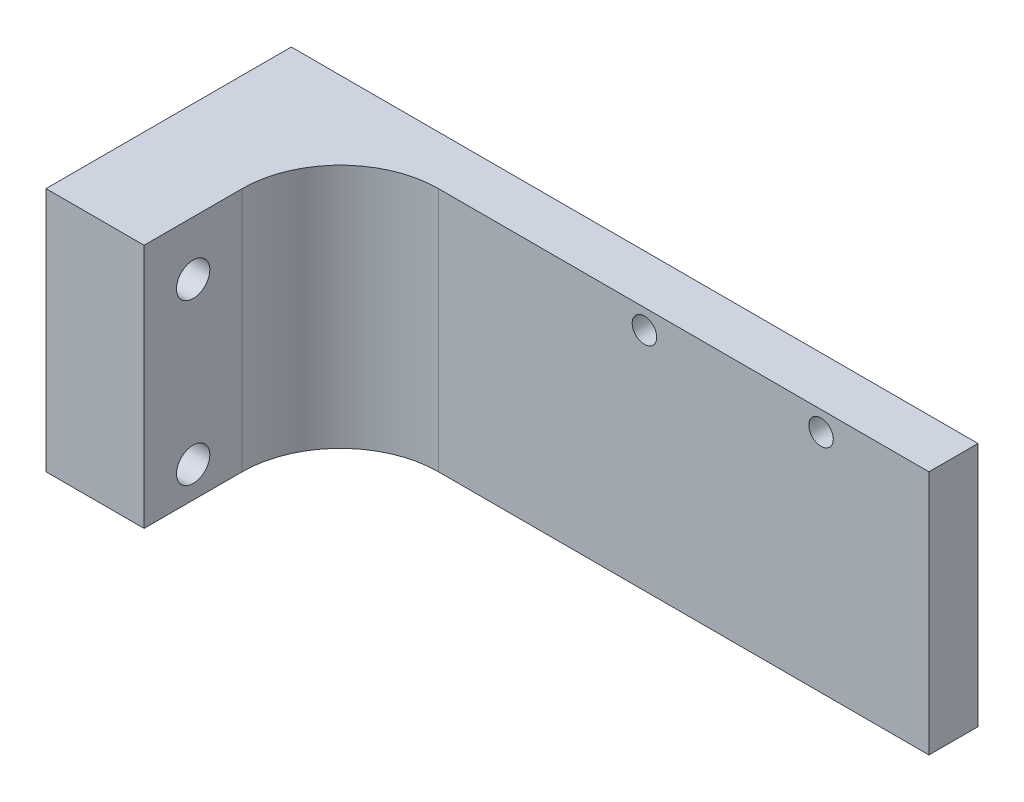
ISO-10303-21;
HEADER;
FILE_DESCRIPTION(('STEP AP214'),'2;1');
FILE_NAME('part.step','',(''),(''),'','','');
FILE_SCHEMA(('AUTOMOTIVE_DESIGN { 1 0 10303 214 1 1 1 1 }'));
ENDSEC;
DATA;
#1=APPLICATION_CONTEXT('core data for automotive mechanical design processes');
#2=APPLICATION_PROTOCOL_DEFINITION('international standard','automotive_design',2000,#1);
#3=PRODUCT_CONTEXT('',#1,'mechanical');
#4=PRODUCT('Part','Part','',(#3));
#5=PRODUCT_RELATED_PRODUCT_CATEGORY('part','',(#4));
#6=PRODUCT_DEFINITION_FORMATION('','',#4);
#7=PRODUCT_DEFINITION_CONTEXT('part definition',#1,'design');
#8=PRODUCT_DEFINITION('design','',#6,#7);
#9=PRODUCT_DEFINITION_SHAPE('','',#8);
#10=(LENGTH_UNIT() NAMED_UNIT(*) SI_UNIT(.MILLI.,.METRE.));
#11=(NAMED_UNIT(*) PLANE_ANGLE_UNIT() SI_UNIT($,.RADIAN.));
#12=(NAMED_UNIT(*) SI_UNIT($,.STERADIAN.) SOLID_ANGLE_UNIT());
#13=UNCERTAINTY_MEASURE_WITH_UNIT(LENGTH_MEASURE(1.E-05),#10,'distance_accuracy_value','');
#14=(GEOMETRIC_REPRESENTATION_CONTEXT(3) GLOBAL_UNCERTAINTY_ASSIGNED_CONTEXT((#13)) GLOBAL_UNIT_ASSIGNED_CONTEXT((#10,
#11,#12)) REPRESENTATION_CONTEXT('',''));
#15=CARTESIAN_POINT('',(0.,0.,0.));
#16=DIRECTION('',(0.,0.,1.));
#17=DIRECTION('',(1.,0.,0.));
#18=AXIS2_PLACEMENT_3D('',#15,#16,#17);
#19=CARTESIAN_POINT('',(0.,0.,5.));
#20=DIRECTION('',(1.,0.,0.));
#21=DIRECTION('',(0.,1.,0.));
#22=AXIS2_PLACEMENT_3D('',#19,#20,#21);
#23=PLANE('',#22);
#24=CARTESIAN_POINT('',(0.,-21.8349192381209,20.));
#25=DIRECTION('',(1.,0.,0.));
#26=DIRECTION('',(0.,1.,0.));
#27=AXIS2_PLACEMENT_3D('',#24,#25,#26);
#28=CIRCLE('',#27,1.7);
#29=CARTESIAN_POINT('',(0.,-20.1349192381209,20.));
#30=VERTEX_POINT('',#29);
#31=EDGE_CURVE('E120',#30,#30,#28,.T.);
#32=ORIENTED_EDGE('',*,*,#31,.T.);
#33=EDGE_LOOP('',(#32));
#34=FACE_BOUND('',#33,.T.);
#35=CARTESIAN_POINT('',(0.,-5.50310841636206,20.));
#36=DIRECTION('',(1.,0.,0.));
#37=DIRECTION('',(0.,1.,0.));
#38=AXIS2_PLACEMENT_3D('',#35,#36,#37);
#39=CIRCLE('',#38,1.7);
#40=CARTESIAN_POINT('',(0.,-3.80310841636206,20.));
#41=VERTEX_POINT('',#40);
#42=EDGE_CURVE('E255',#41,#41,#39,.T.);
#43=ORIENTED_EDGE('',*,*,#42,.T.);
#44=EDGE_LOOP('',(#43));
#45=FACE_BOUND('',#44,.T.);
#46=DIRECTION('',(0.,-1.,0.));
#47=VECTOR('',#46,1.);
#48=CARTESIAN_POINT('',(0.,0.,0.));
#49=LINE('',#48,#47);
#50=CARTESIAN_POINT('',(0.,0.,0.));
#51=VERTEX_POINT('',#50);
#52=CARTESIAN_POINT('',(0.,-25.,0.));
#53=VERTEX_POINT('',#52);
#54=EDGE_CURVE('E142',#51,#53,#49,.T.);
#55=ORIENTED_EDGE('',*,*,#54,.T.);
#56=DIRECTION('',(0.,0.,-1.));
#57=VECTOR('',#56,1.);
#58=CARTESIAN_POINT('',(0.,-25.,5.));
#59=LINE('',#58,#57);
#60=CARTESIAN_POINT('',(0.,-25.,25.));
#61=VERTEX_POINT('',#60);
#62=EDGE_CURVE('E181',#61,#53,#59,.T.);
#63=ORIENTED_EDGE('',*,*,#62,.F.);
#64=DIRECTION('',(0.,-1.,0.));
#65=VECTOR('',#64,1.);
#66=CARTESIAN_POINT('',(0.,0.,25.));
#67=LINE('',#66,#65);
#68=CARTESIAN_POINT('',(0.,0.,25.));
#69=VERTEX_POINT('',#68);
#70=EDGE_CURVE('E109',#69,#61,#67,.T.);
#71=ORIENTED_EDGE('',*,*,#70,.F.);
#72=DIRECTION('',(0.,0.,-1.));
#73=VECTOR('',#72,1.);
#74=CARTESIAN_POINT('',(0.,0.,5.));
#75=LINE('',#74,#73);
#76=EDGE_CURVE('E104',#69,#51,#75,.T.);
#77=ORIENTED_EDGE('',*,*,#76,.T.);
#78=EDGE_LOOP('',(#55,#63,#71,#77));
#79=FACE_BOUND('',#78,.T.);
#80=ADVANCED_FACE('F41',(#34,#45,#79),#23,.F.);
#81=CARTESIAN_POINT('',(0.,-25.,5.));
#82=DIRECTION('',(0.,1.,0.));
#83=DIRECTION('',(0.,0.,1.));
#84=AXIS2_PLACEMENT_3D('',#81,#82,#83);
#85=PLANE('',#84);
#86=DIRECTION('',(1.,0.,0.));
#87=VECTOR('',#86,1.);
#88=CARTESIAN_POINT('',(0.,-25.,0.));
#89=LINE('',#88,#87);
#90=CARTESIAN_POINT('',(70.,-25.,0.));
#91=VERTEX_POINT('',#90);
#92=EDGE_CURVE('E163',#53,#91,#89,.T.);
#93=ORIENTED_EDGE('',*,*,#92,.T.);
#94=DIRECTION('',(0.,0.,-1.));
#95=VECTOR('',#94,1.);
#96=CARTESIAN_POINT('',(70.,-25.,5.));
#97=LINE('',#96,#95);
#98=CARTESIAN_POINT('',(70.,-25.,5.));
#99=VERTEX_POINT('',#98);
#100=EDGE_CURVE('E177',#99,#91,#97,.T.);
#101=ORIENTED_EDGE('',*,*,#100,.F.);
#102=DIRECTION('',(1.,0.,0.));
#103=VECTOR('',#102,1.);
#104=CARTESIAN_POINT('',(0.,-25.,5.));
#105=LINE('',#104,#103);
#106=CARTESIAN_POINT('',(20.,-25.,5.));
#107=VERTEX_POINT('',#106);
#108=EDGE_CURVE('E150',#107,#99,#105,.T.);
#109=ORIENTED_EDGE('',*,*,#108,.F.);
#110=CARTESIAN_POINT('',(20.,-25.,15.));
#111=DIRECTION('',(0.,1.,0.));
#112=DIRECTION('',(0.,0.,1.));
#113=AXIS2_PLACEMENT_3D('',#110,#111,#112);
#114=CIRCLE('',#113,10.);
#115=CARTESIAN_POINT('',(10.,-25.,15.));
#116=VERTEX_POINT('',#115);
#117=EDGE_CURVE('E11',#107,#116,#114,.T.);
#118=ORIENTED_EDGE('',*,*,#117,.T.);
#119=DIRECTION('',(0.,0.,-1.));
#120=VECTOR('',#119,1.);
#121=CARTESIAN_POINT('',(10.,-25.,25.));
#122=LINE('',#121,#120);
#123=CARTESIAN_POINT('',(10.,-25.,25.));
#124=VERTEX_POINT('',#123);
#125=EDGE_CURVE('E128',#124,#116,#122,.T.);
#126=ORIENTED_EDGE('',*,*,#125,.F.);
#127=DIRECTION('',(1.,0.,0.));
#128=VECTOR('',#127,1.);
#129=CARTESIAN_POINT('',(0.,-25.,25.));
#130=LINE('',#129,#128);
#131=EDGE_CURVE('E115',#61,#124,#130,.T.);
#132=ORIENTED_EDGE('',*,*,#131,.F.);
#133=ORIENTED_EDGE('',*,*,#62,.T.);
#134=EDGE_LOOP('',(#93,#101,#109,#118,#126,#132,#133));
#135=FACE_BOUND('',#134,.T.);
#136=ADVANCED_FACE('F190',(#135),#85,.F.);
#137=CARTESIAN_POINT('',(70.,0.,5.));
#138=DIRECTION('',(-1.,0.,0.));
#139=DIRECTION('',(0.,0.,1.));
#140=AXIS2_PLACEMENT_3D('',#137,#138,#139);
#141=PLANE('',#140);
#142=DIRECTION('',(0.,1.,0.));
#143=VECTOR('',#142,1.);
#144=CARTESIAN_POINT('',(70.,0.,0.));
#145=LINE('',#144,#143);
#146=CARTESIAN_POINT('',(70.,0.,0.));
#147=VERTEX_POINT('',#146);
#148=EDGE_CURVE('E166',#91,#147,#145,.T.);
#149=ORIENTED_EDGE('',*,*,#148,.T.);
#150=DIRECTION('',(0.,0.,-1.));
#151=VECTOR('',#150,1.);
#152=CARTESIAN_POINT('',(70.,0.,5.));
#153=LINE('',#152,#151);
#154=CARTESIAN_POINT('',(70.,0.,5.));
#155=VERTEX_POINT('',#154);
#156=EDGE_CURVE('E173',#155,#147,#153,.T.);
#157=ORIENTED_EDGE('',*,*,#156,.F.);
#158=DIRECTION('',(0.,1.,0.));
#159=VECTOR('',#158,1.);
#160=CARTESIAN_POINT('',(70.,0.,5.));
#161=LINE('',#160,#159);
#162=EDGE_CURVE('E153',#99,#155,#161,.T.);
#163=ORIENTED_EDGE('',*,*,#162,.F.);
#164=ORIENTED_EDGE('',*,*,#100,.T.);
#165=EDGE_LOOP('',(#149,#157,#163,#164));
#166=FACE_BOUND('',#165,.T.);
#167=ADVANCED_FACE('F200',(#166),#141,.F.);
#168=CARTESIAN_POINT('',(0.,0.,5.));
#169=DIRECTION('',(0.,-1.,0.));
#170=DIRECTION('',(0.,0.,-1.));
#171=AXIS2_PLACEMENT_3D('',#168,#169,#170);
#172=PLANE('',#171);
#173=DIRECTION('',(-1.,0.,0.));
#174=VECTOR('',#173,1.);
#175=CARTESIAN_POINT('',(0.,0.,0.));
#176=LINE('',#175,#174);
#177=EDGE_CURVE('E154',#147,#51,#176,.T.);
#178=ORIENTED_EDGE('',*,*,#177,.T.);
#179=ORIENTED_EDGE('',*,*,#76,.F.);
#180=DIRECTION('',(-1.,0.,0.));
#181=VECTOR('',#180,1.);
#182=CARTESIAN_POINT('',(0.,0.,25.));
#183=LINE('',#182,#181);
#184=CARTESIAN_POINT('',(10.,0.,25.));
#185=VERTEX_POINT('',#184);
#186=EDGE_CURVE('E98',#185,#69,#183,.T.);
#187=ORIENTED_EDGE('',*,*,#186,.F.);
#188=DIRECTION('',(0.,0.,-1.));
#189=VECTOR('',#188,1.);
#190=CARTESIAN_POINT('',(10.,0.,25.));
#191=LINE('',#190,#189);
#192=CARTESIAN_POINT('',(10.,0.,15.));
#193=VERTEX_POINT('',#192);
#194=EDGE_CURVE('E102',#185,#193,#191,.T.);
#195=ORIENTED_EDGE('',*,*,#194,.T.);
#196=CARTESIAN_POINT('',(20.,0.,15.));
#197=DIRECTION('',(0.,-1.,0.));
#198=DIRECTION('',(0.,0.,-1.));
#199=AXIS2_PLACEMENT_3D('',#196,#197,#198);
#200=CIRCLE('',#199,10.);
#201=CARTESIAN_POINT('',(20.,0.,5.));
#202=VERTEX_POINT('',#201);
#203=EDGE_CURVE('E50',#193,#202,#200,.T.);
#204=ORIENTED_EDGE('',*,*,#203,.T.);
#205=DIRECTION('',(-1.,0.,0.));
#206=VECTOR('',#205,1.);
#207=CARTESIAN_POINT('',(0.,0.,5.));
#208=LINE('',#207,#206);
#209=EDGE_CURVE('E157',#155,#202,#208,.T.);
#210=ORIENTED_EDGE('',*,*,#209,.F.);
#211=ORIENTED_EDGE('',*,*,#156,.T.);
#212=EDGE_LOOP('',(#178,#179,#187,#195,#204,#210,#211));
#213=FACE_BOUND('',#212,.T.);
#214=ADVANCED_FACE('F100',(#213),#172,.F.);
#215=CARTESIAN_POINT('',(0.,0.,5.));
#216=DIRECTION('',(0.,0.,1.));
#217=DIRECTION('',(1.,0.,0.));
#218=AXIS2_PLACEMENT_3D('',#215,#216,#217);
#219=PLANE('',#218);
#220=ORIENTED_EDGE('',*,*,#209,.T.);
#221=DIRECTION('',(0.,1.,0.));
#222=VECTOR('',#221,1.);
#223=CARTESIAN_POINT('',(20.,0.,5.));
#224=LINE('',#223,#222);
#225=EDGE_CURVE('E63',#202,#107,#224,.F.);
#226=ORIENTED_EDGE('',*,*,#225,.T.);
#227=ORIENTED_EDGE('',*,*,#108,.T.);
#228=ORIENTED_EDGE('',*,*,#162,.T.);
#229=EDGE_LOOP('',(#220,#226,#227,#228));
#230=FACE_BOUND('',#229,.T.);
#231=CARTESIAN_POINT('',(41.,-2.,5.));
#232=DIRECTION('',(0.,0.,1.));
#233=DIRECTION('',(1.,0.,0.));
#234=AXIS2_PLACEMENT_3D('',#231,#232,#233);
#235=CIRCLE('',#234,1.25);
#236=CARTESIAN_POINT('',(42.25,-2.,5.));
#237=VERTEX_POINT('',#236);
#238=EDGE_CURVE('E143',#237,#237,#235,.T.);
#239=ORIENTED_EDGE('',*,*,#238,.F.);
#240=EDGE_LOOP('',(#239));
#241=FACE_BOUND('',#240,.T.);
#242=CARTESIAN_POINT('',(59.,-2.,5.));
#243=DIRECTION('',(0.,0.,1.));
#244=DIRECTION('',(1.,0.,0.));
#245=AXIS2_PLACEMENT_3D('',#242,#243,#244);
#246=CIRCLE('',#245,1.25);
#247=CARTESIAN_POINT('',(60.25,-2.,5.));
#248=VERTEX_POINT('',#247);
#249=EDGE_CURVE('E127',#248,#248,#246,.T.);
#250=ORIENTED_EDGE('',*,*,#249,.F.);
#251=EDGE_LOOP('',(#250));
#252=FACE_BOUND('',#251,.T.);
#253=ADVANCED_FACE('F202',(#230,#241,#252),#219,.T.);
#254=CARTESIAN_POINT('',(0.,0.,0.));
#255=DIRECTION('',(0.,0.,1.));
#256=DIRECTION('',(1.,0.,0.));
#257=AXIS2_PLACEMENT_3D('',#254,#255,#256);
#258=PLANE('',#257);
#259=CARTESIAN_POINT('',(41.,-2.,0.));
#260=DIRECTION('',(0.,0.,1.));
#261=DIRECTION('',(1.,0.,0.));
#262=AXIS2_PLACEMENT_3D('',#259,#260,#261);
#263=CIRCLE('',#262,1.25);
#264=CARTESIAN_POINT('',(42.25,-2.,0.));
#265=VERTEX_POINT('',#264);
#266=EDGE_CURVE('E138',#265,#265,#263,.T.);
#267=ORIENTED_EDGE('',*,*,#266,.T.);
#268=EDGE_LOOP('',(#267));
#269=FACE_BOUND('',#268,.T.);
#270=CARTESIAN_POINT('',(59.,-2.,0.));
#271=DIRECTION('',(0.,0.,1.));
#272=DIRECTION('',(1.,0.,0.));
#273=AXIS2_PLACEMENT_3D('',#270,#271,#272);
#274=CIRCLE('',#273,1.25);
#275=CARTESIAN_POINT('',(60.25,-2.,0.));
#276=VERTEX_POINT('',#275);
#277=EDGE_CURVE('E133',#276,#276,#274,.T.);
#278=ORIENTED_EDGE('',*,*,#277,.T.);
#279=EDGE_LOOP('',(#278));
#280=FACE_BOUND('',#279,.T.);
#281=ORIENTED_EDGE('',*,*,#54,.F.);
#282=ORIENTED_EDGE('',*,*,#177,.F.);
#283=ORIENTED_EDGE('',*,*,#148,.F.);
#284=ORIENTED_EDGE('',*,*,#92,.F.);
#285=EDGE_LOOP('',(#281,#282,#283,#284));
#286=FACE_BOUND('',#285,.T.);
#287=ADVANCED_FACE('F196',(#269,#280,#286),#258,.F.);
#288=CARTESIAN_POINT('',(59.,-2.,0.));
#289=DIRECTION('',(0.,0.,1.));
#290=DIRECTION('',(1.,0.,0.));
#291=AXIS2_PLACEMENT_3D('',#288,#289,#290);
#292=CYLINDRICAL_SURFACE('',#291,1.25);
#293=ORIENTED_EDGE('',*,*,#277,.F.);
#294=EDGE_LOOP('',(#293));
#295=FACE_BOUND('',#294,.T.);
#296=ORIENTED_EDGE('',*,*,#249,.T.);
#297=EDGE_LOOP('',(#296));
#298=FACE_BOUND('',#297,.T.);
#299=ADVANCED_FACE('F231',(#295,#298),#292,.F.);
#300=CARTESIAN_POINT('',(41.,-2.,0.));
#301=DIRECTION('',(0.,0.,1.));
#302=DIRECTION('',(1.,0.,0.));
#303=AXIS2_PLACEMENT_3D('',#300,#301,#302);
#304=CYLINDRICAL_SURFACE('',#303,1.25);
#305=ORIENTED_EDGE('',*,*,#266,.F.);
#306=EDGE_LOOP('',(#305));
#307=FACE_BOUND('',#306,.T.);
#308=ORIENTED_EDGE('',*,*,#238,.T.);
#309=EDGE_LOOP('',(#308));
#310=FACE_BOUND('',#309,.T.);
#311=ADVANCED_FACE('F237',(#307,#310),#304,.F.);
#312=CARTESIAN_POINT('',(10.,0.,25.));
#313=DIRECTION('',(-1.,0.,0.));
#314=DIRECTION('',(0.,-1.,0.));
#315=AXIS2_PLACEMENT_3D('',#312,#313,#314);
#316=PLANE('',#315);
#317=CARTESIAN_POINT('',(10.,-21.8349192381209,20.));
#318=DIRECTION('',(1.,0.,0.));
#319=DIRECTION('',(0.,1.,0.));
#320=AXIS2_PLACEMENT_3D('',#317,#318,#319);
#321=CIRCLE('',#320,1.7);
#322=CARTESIAN_POINT('',(10.,-20.1349192381209,20.));
#323=VERTEX_POINT('',#322);
#324=EDGE_CURVE('E253',#323,#323,#321,.T.);
#325=ORIENTED_EDGE('',*,*,#324,.F.);
#326=EDGE_LOOP('',(#325));
#327=FACE_BOUND('',#326,.T.);
#328=CARTESIAN_POINT('',(10.,-5.50310841636205,20.));
#329=DIRECTION('',(1.,0.,0.));
#330=DIRECTION('',(0.,1.,0.));
#331=AXIS2_PLACEMENT_3D('',#328,#329,#330);
#332=CIRCLE('',#331,1.7);
#333=CARTESIAN_POINT('',(10.,-3.80310841636205,20.));
#334=VERTEX_POINT('',#333);
#335=EDGE_CURVE('E261',#334,#334,#332,.T.);
#336=ORIENTED_EDGE('',*,*,#335,.F.);
#337=EDGE_LOOP('',(#336));
#338=FACE_BOUND('',#337,.T.);
#339=ORIENTED_EDGE('',*,*,#125,.T.);
#340=DIRECTION('',(0.,1.,0.));
#341=VECTOR('',#340,1.);
#342=CARTESIAN_POINT('',(10.,0.,15.));
#343=LINE('',#342,#341);
#344=EDGE_CURVE('E125',#116,#193,#343,.T.);
#345=ORIENTED_EDGE('',*,*,#344,.T.);
#346=ORIENTED_EDGE('',*,*,#194,.F.);
#347=DIRECTION('',(0.,1.,0.));
#348=VECTOR('',#347,1.);
#349=CARTESIAN_POINT('',(10.,0.,25.));
#350=LINE('',#349,#348);
#351=EDGE_CURVE('E110',#124,#185,#350,.T.);
#352=ORIENTED_EDGE('',*,*,#351,.F.);
#353=EDGE_LOOP('',(#339,#345,#346,#352));
#354=FACE_BOUND('',#353,.T.);
#355=ADVANCED_FACE('F123',(#327,#338,#354),#316,.F.);
#356=CARTESIAN_POINT('',(0.,0.,25.));
#357=DIRECTION('',(0.,0.,1.));
#358=DIRECTION('',(1.,0.,0.));
#359=AXIS2_PLACEMENT_3D('',#356,#357,#358);
#360=PLANE('',#359);
#361=ORIENTED_EDGE('',*,*,#351,.T.);
#362=ORIENTED_EDGE('',*,*,#186,.T.);
#363=ORIENTED_EDGE('',*,*,#70,.T.);
#364=ORIENTED_EDGE('',*,*,#131,.T.);
#365=EDGE_LOOP('',(#361,#362,#363,#364));
#366=FACE_BOUND('',#365,.T.);
#367=ADVANCED_FACE('F113',(#366),#360,.T.);
#368=CARTESIAN_POINT('',(20.,0.,15.));
#369=DIRECTION('',(0.,1.,0.));
#370=DIRECTION('',(-1.,0.,0.));
#371=AXIS2_PLACEMENT_3D('',#368,#369,#370);
#372=CYLINDRICAL_SURFACE('',#371,10.);
#373=ORIENTED_EDGE('',*,*,#117,.F.);
#374=ORIENTED_EDGE('',*,*,#225,.F.);
#375=ORIENTED_EDGE('',*,*,#203,.F.);
#376=ORIENTED_EDGE('',*,*,#344,.F.);
#377=EDGE_LOOP('',(#373,#374,#375,#376));
#378=FACE_BOUND('',#377,.T.);
#379=ADVANCED_FACE('F43',(#378),#372,.F.);
#380=CARTESIAN_POINT('',(0.,-5.50310841636206,20.));
#381=DIRECTION('',(1.,0.,0.));
#382=DIRECTION('',(0.,1.,0.));
#383=AXIS2_PLACEMENT_3D('',#380,#381,#382);
#384=CYLINDRICAL_SURFACE('',#383,1.7);
#385=ORIENTED_EDGE('',*,*,#42,.F.);
#386=EDGE_LOOP('',(#385));
#387=FACE_BOUND('',#386,.T.);
#388=ORIENTED_EDGE('',*,*,#335,.T.);
#389=EDGE_LOOP('',(#388));
#390=FACE_BOUND('',#389,.T.);
#391=ADVANCED_FACE('F207',(#387,#390),#384,.F.);
#392=CARTESIAN_POINT('',(0.,-21.8349192381209,20.));
#393=DIRECTION('',(1.,0.,0.));
#394=DIRECTION('',(0.,1.,0.));
#395=AXIS2_PLACEMENT_3D('',#392,#393,#394);
#396=CYLINDRICAL_SURFACE('',#395,1.7);
#397=ORIENTED_EDGE('',*,*,#31,.F.);
#398=EDGE_LOOP('',(#397));
#399=FACE_BOUND('',#398,.T.);
#400=ORIENTED_EDGE('',*,*,#324,.T.);
#401=EDGE_LOOP('',(#400));
#402=FACE_BOUND('',#401,.T.);
#403=ADVANCED_FACE('F212',(#399,#402),#396,.F.);
#404=CLOSED_SHELL('',(#80,#136,#167,#214,#253,#287,#299,#311,#355,#367,#379,#391,#403));
#405=MANIFOLD_SOLID_BREP('B2',#404);
#406=ADVANCED_BREP_SHAPE_REPRESENTATION('',(#18,#405),#14);
#407=SHAPE_DEFINITION_REPRESENTATION(#9,#406);
ENDSEC;
END-ISO-10303-21;
